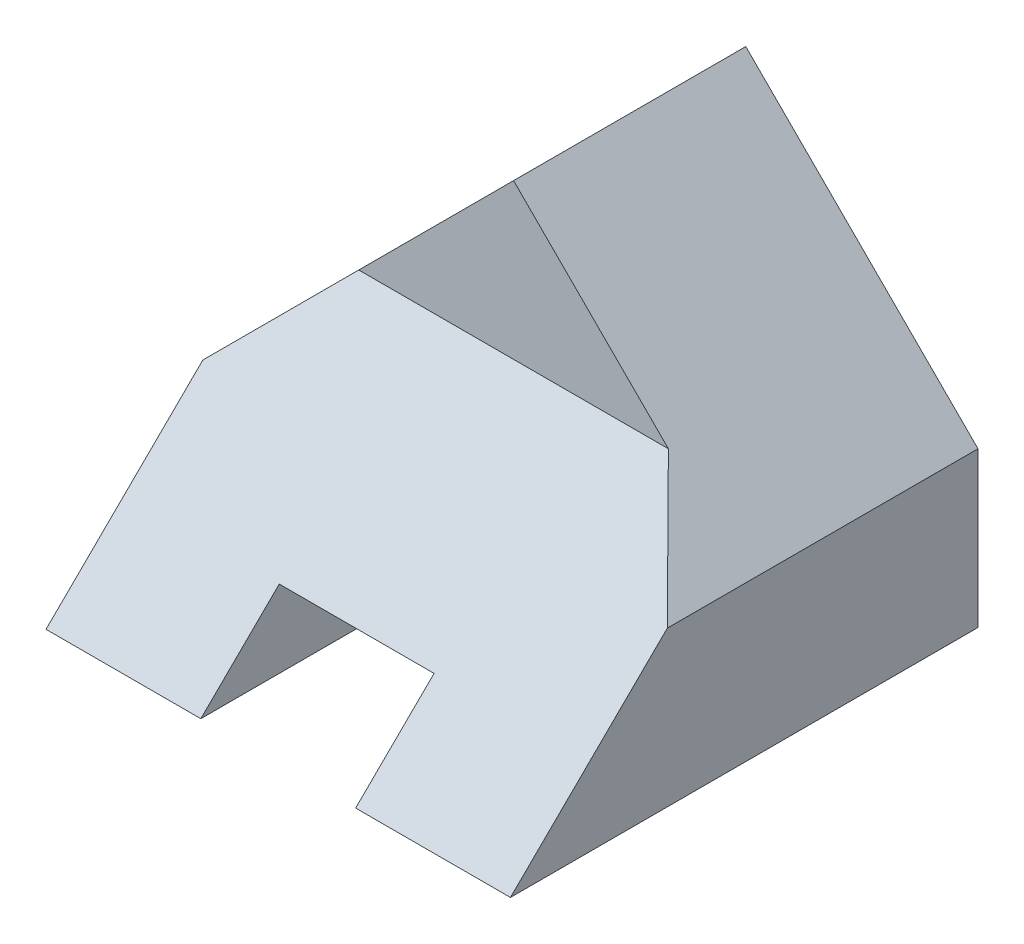
ISO-10303-21;
HEADER;
FILE_DESCRIPTION(('STEP AP214'),'2;1');
FILE_NAME('part.step','',(''),(''),'','','');
FILE_SCHEMA(('AUTOMOTIVE_DESIGN { 1 0 10303 214 1 1 1 1 }'));
ENDSEC;
DATA;
#1=APPLICATION_CONTEXT('core data for automotive mechanical design processes');
#2=APPLICATION_PROTOCOL_DEFINITION('international standard','automotive_design',2000,#1);
#3=PRODUCT_CONTEXT('',#1,'mechanical');
#4=PRODUCT('Part','Part','',(#3));
#5=PRODUCT_RELATED_PRODUCT_CATEGORY('part','',(#4));
#6=PRODUCT_DEFINITION_FORMATION('','',#4);
#7=PRODUCT_DEFINITION_CONTEXT('part definition',#1,'design');
#8=PRODUCT_DEFINITION('design','',#6,#7);
#9=PRODUCT_DEFINITION_SHAPE('','',#8);
#10=(LENGTH_UNIT() NAMED_UNIT(*) SI_UNIT(.MILLI.,.METRE.));
#11=(NAMED_UNIT(*) PLANE_ANGLE_UNIT() SI_UNIT($,.RADIAN.));
#12=(NAMED_UNIT(*) SI_UNIT($,.STERADIAN.) SOLID_ANGLE_UNIT());
#13=UNCERTAINTY_MEASURE_WITH_UNIT(LENGTH_MEASURE(1.E-05),#10,'distance_accuracy_value','');
#14=(GEOMETRIC_REPRESENTATION_CONTEXT(3) GLOBAL_UNCERTAINTY_ASSIGNED_CONTEXT((#13)) GLOBAL_UNIT_ASSIGNED_CONTEXT((#10,
#11,#12)) REPRESENTATION_CONTEXT('',''));
#15=CARTESIAN_POINT('',(0.,0.,0.));
#16=DIRECTION('',(0.,0.,1.));
#17=DIRECTION('',(1.,0.,0.));
#18=AXIS2_PLACEMENT_3D('',#15,#16,#17);
#19=CARTESIAN_POINT('',(-3.,3.,0.));
#20=DIRECTION('',(0.,0.711795278981086,0.702386987934884));
#21=DIRECTION('',(0.,-0.702386987934884,0.711795278981086));
#22=AXIS2_PLACEMENT_3D('',#19,#20,#21);
#23=PLANE('',#22);
#24=DIRECTION('',(1.,0.,0.));
#25=VECTOR('',#24,1.);
#26=CARTESIAN_POINT('',(-3.,1.,2.02678947989587));
#27=LINE('',#26,#25);
#28=CARTESIAN_POINT('',(-1.,0.999999999999999,2.02678947989588));
#29=VERTEX_POINT('',#28);
#30=CARTESIAN_POINT('',(1.,1.,2.02678947989587));
#31=VERTEX_POINT('',#30);
#32=EDGE_CURVE('E11',#29,#31,#27,.T.);
#33=ORIENTED_EDGE('',*,*,#32,.T.);
#34=DIRECTION('',(0.,-0.702386987934884,0.711795278981086));
#35=VECTOR('',#34,1.);
#36=CARTESIAN_POINT('',(1.,3.,0.));
#37=LINE('',#36,#35);
#38=CARTESIAN_POINT('',(1.,0.,3.04018421984381));
#39=VERTEX_POINT('',#38);
#40=EDGE_CURVE('E182',#31,#39,#37,.T.);
#41=ORIENTED_EDGE('',*,*,#40,.T.);
#42=DIRECTION('',(1.,0.,0.));
#43=VECTOR('',#42,1.);
#44=CARTESIAN_POINT('',(-3.,0.,3.04018421984381));
#45=LINE('',#44,#43);
#46=CARTESIAN_POINT('',(3.,0.,3.04018421984381));
#47=VERTEX_POINT('',#46);
#48=EDGE_CURVE('E129',#39,#47,#45,.T.);
#49=ORIENTED_EDGE('',*,*,#48,.T.);
#50=DIRECTION('',(0.,-0.702386987934884,0.711795278981086));
#51=VECTOR('',#50,1.);
#52=CARTESIAN_POINT('',(3.,3.,0.));
#53=LINE('',#52,#51);
#54=CARTESIAN_POINT('',(3.,2.,1.01339473994794));
#55=VERTEX_POINT('',#54);
#56=EDGE_CURVE('E175',#55,#47,#53,.T.);
#57=ORIENTED_EDGE('',*,*,#56,.F.);
#58=DIRECTION('',(-0.574772552263184,0.574772552263184,-0.582471481129961));
#59=VECTOR('',#58,1.);
#60=CARTESIAN_POINT('',(0.348182565824324,4.65181743417567,-1.67394309914792));
#61=LINE('',#60,#59);
#62=CARTESIAN_POINT('',(2.,3.,0.));
#63=VERTEX_POINT('',#62);
#64=EDGE_CURVE('E179',#55,#63,#61,.T.);
#65=ORIENTED_EDGE('',*,*,#64,.T.);
#66=DIRECTION('',(1.,0.,0.));
#67=VECTOR('',#66,1.);
#68=CARTESIAN_POINT('',(-3.,3.,0.));
#69=LINE('',#68,#67);
#70=CARTESIAN_POINT('',(-2.,3.,0.));
#71=VERTEX_POINT('',#70);
#72=EDGE_CURVE('E135',#71,#63,#69,.T.);
#73=ORIENTED_EDGE('',*,*,#72,.F.);
#74=DIRECTION('',(-0.574772552263184,-0.574772552263184,0.582471481129961));
#75=VECTOR('',#74,1.);
#76=CARTESIAN_POINT('',(-2.33036348683514,2.66963651316487,0.334788619829585));
#77=LINE('',#76,#75);
#78=CARTESIAN_POINT('',(-3.,2.,1.01339473994794));
#79=VERTEX_POINT('',#78);
#80=EDGE_CURVE('E131',#71,#79,#77,.T.);
#81=ORIENTED_EDGE('',*,*,#80,.T.);
#82=DIRECTION('',(0.,-0.702386987934884,0.711795278981086));
#83=VECTOR('',#82,1.);
#84=CARTESIAN_POINT('',(-3.,3.,0.));
#85=LINE('',#84,#83);
#86=CARTESIAN_POINT('',(-3.,0.,3.04018421984381));
#87=VERTEX_POINT('',#86);
#88=EDGE_CURVE('E178',#79,#87,#85,.T.);
#89=ORIENTED_EDGE('',*,*,#88,.T.);
#90=CARTESIAN_POINT('',(-1.,0.,3.04018421984381));
#91=VERTEX_POINT('',#90);
#92=EDGE_CURVE('E158',#87,#91,#45,.T.);
#93=ORIENTED_EDGE('',*,*,#92,.T.);
#94=DIRECTION('',(0.,0.702386987934884,-0.711795278981086));
#95=VECTOR('',#94,1.);
#96=CARTESIAN_POINT('',(-1.,3.,0.));
#97=LINE('',#96,#95);
#98=EDGE_CURVE('E184',#91,#29,#97,.T.);
#99=ORIENTED_EDGE('',*,*,#98,.T.);
#100=EDGE_LOOP('',(#33,#41,#49,#57,#65,#73,#81,#89,#93,#99));
#101=FACE_BOUND('',#100,.T.);
#102=ADVANCED_FACE('F33',(#101),#23,.T.);
#103=CARTESIAN_POINT('',(3.,0.,-3.));
#104=DIRECTION('',(0.,-1.,0.));
#105=DIRECTION('',(1.,0.,0.));
#106=AXIS2_PLACEMENT_3D('',#103,#104,#105);
#107=PLANE('',#106);
#108=ORIENTED_EDGE('',*,*,#48,.F.);
#109=DIRECTION('',(0.,0.,-1.));
#110=VECTOR('',#109,1.);
#111=CARTESIAN_POINT('',(1.,0.,-3.));
#112=LINE('',#111,#110);
#113=CARTESIAN_POINT('',(1.,0.,0.));
#114=VERTEX_POINT('',#113);
#115=EDGE_CURVE('E41',#39,#114,#112,.T.);
#116=ORIENTED_EDGE('',*,*,#115,.T.);
#117=DIRECTION('',(1.,0.,0.));
#118=VECTOR('',#117,1.);
#119=CARTESIAN_POINT('',(1.,0.,0.));
#120=LINE('',#119,#118);
#121=CARTESIAN_POINT('',(-1.,0.,0.));
#122=VERTEX_POINT('',#121);
#123=EDGE_CURVE('E119',#122,#114,#120,.T.);
#124=ORIENTED_EDGE('',*,*,#123,.F.);
#125=DIRECTION('',(0.,0.,1.));
#126=VECTOR('',#125,1.);
#127=CARTESIAN_POINT('',(-1.,0.,-3.));
#128=LINE('',#127,#126);
#129=EDGE_CURVE('E130',#122,#91,#128,.T.);
#130=ORIENTED_EDGE('',*,*,#129,.T.);
#131=ORIENTED_EDGE('',*,*,#92,.F.);
#132=DIRECTION('',(0.,0.,1.));
#133=VECTOR('',#132,1.);
#134=CARTESIAN_POINT('',(-3.,0.,-3.));
#135=LINE('',#134,#133);
#136=CARTESIAN_POINT('',(-3.,0.,-3.));
#137=VERTEX_POINT('',#136);
#138=EDGE_CURVE('E145',#137,#87,#135,.T.);
#139=ORIENTED_EDGE('',*,*,#138,.F.);
#140=DIRECTION('',(1.,0.,0.));
#141=VECTOR('',#140,1.);
#142=CARTESIAN_POINT('',(3.,0.,-3.));
#143=LINE('',#142,#141);
#144=CARTESIAN_POINT('',(3.,0.,-3.));
#145=VERTEX_POINT('',#144);
#146=EDGE_CURVE('E166',#137,#145,#143,.T.);
#147=ORIENTED_EDGE('',*,*,#146,.T.);
#148=DIRECTION('',(0.,0.,1.));
#149=VECTOR('',#148,1.);
#150=CARTESIAN_POINT('',(3.,0.,-3.));
#151=LINE('',#150,#149);
#152=EDGE_CURVE('E141',#145,#47,#151,.T.);
#153=ORIENTED_EDGE('',*,*,#152,.T.);
#154=EDGE_LOOP('',(#108,#116,#124,#130,#131,#139,#147,#153));
#155=FACE_BOUND('',#154,.T.);
#156=ADVANCED_FACE('F127',(#155),#107,.T.);
#157=CARTESIAN_POINT('',(3.,0.,-3.));
#158=DIRECTION('',(1.,0.,0.));
#159=DIRECTION('',(0.,0.,-1.));
#160=AXIS2_PLACEMENT_3D('',#157,#158,#159);
#161=PLANE('',#160);
#162=DIRECTION('',(0.,0.,1.));
#163=VECTOR('',#162,1.);
#164=CARTESIAN_POINT('',(3.,2.,-3.));
#165=LINE('',#164,#163);
#166=CARTESIAN_POINT('',(3.,2.,-3.));
#167=VERTEX_POINT('',#166);
#168=EDGE_CURVE('E138',#167,#55,#165,.T.);
#169=ORIENTED_EDGE('',*,*,#168,.T.);
#170=ORIENTED_EDGE('',*,*,#56,.T.);
#171=ORIENTED_EDGE('',*,*,#152,.F.);
#172=DIRECTION('',(0.,1.,0.));
#173=VECTOR('',#172,1.);
#174=CARTESIAN_POINT('',(3.,0.,-3.));
#175=LINE('',#174,#173);
#176=EDGE_CURVE('E163',#145,#167,#175,.T.);
#177=ORIENTED_EDGE('',*,*,#176,.T.);
#178=EDGE_LOOP('',(#169,#170,#171,#177));
#179=FACE_BOUND('',#178,.T.);
#180=ADVANCED_FACE('F208',(#179),#161,.T.);
#181=CARTESIAN_POINT('',(-3.,2.,-3.));
#182=DIRECTION('',(-1.,0.,0.));
#183=DIRECTION('',(0.,-1.,0.));
#184=AXIS2_PLACEMENT_3D('',#181,#182,#183);
#185=PLANE('',#184);
#186=ORIENTED_EDGE('',*,*,#88,.F.);
#187=DIRECTION('',(0.,0.,1.));
#188=VECTOR('',#187,1.);
#189=CARTESIAN_POINT('',(-3.,2.,-3.));
#190=LINE('',#189,#188);
#191=CARTESIAN_POINT('',(-3.,2.,-3.));
#192=VERTEX_POINT('',#191);
#193=EDGE_CURVE('E56',#192,#79,#190,.T.);
#194=ORIENTED_EDGE('',*,*,#193,.F.);
#195=DIRECTION('',(0.,-1.,0.));
#196=VECTOR('',#195,1.);
#197=CARTESIAN_POINT('',(-3.,2.,-3.));
#198=LINE('',#197,#196);
#199=EDGE_CURVE('E155',#192,#137,#198,.T.);
#200=ORIENTED_EDGE('',*,*,#199,.T.);
#201=ORIENTED_EDGE('',*,*,#138,.T.);
#202=EDGE_LOOP('',(#186,#194,#200,#201));
#203=FACE_BOUND('',#202,.T.);
#204=ADVANCED_FACE('F35',(#203),#185,.T.);
#205=CARTESIAN_POINT('',(0.,5.,-3.));
#206=DIRECTION('',(-0.707106781186548,0.707106781186547,0.));
#207=DIRECTION('',(-0.707106781186547,-0.707106781186548,0.));
#208=AXIS2_PLACEMENT_3D('',#205,#206,#207);
#209=PLANE('',#208);
#210=DIRECTION('',(-0.707106781186547,-0.707106781186548,0.));
#211=VECTOR('',#210,1.);
#212=CARTESIAN_POINT('',(0.,5.,0.));
#213=LINE('',#212,#211);
#214=CARTESIAN_POINT('',(0.,5.,0.));
#215=VERTEX_POINT('',#214);
#216=EDGE_CURVE('E152',#215,#71,#213,.T.);
#217=ORIENTED_EDGE('',*,*,#216,.F.);
#218=DIRECTION('',(0.,0.,1.));
#219=VECTOR('',#218,1.);
#220=CARTESIAN_POINT('',(0.,5.,-3.));
#221=LINE('',#220,#219);
#222=CARTESIAN_POINT('',(0.,5.,-3.));
#223=VERTEX_POINT('',#222);
#224=EDGE_CURVE('E140',#223,#215,#221,.T.);
#225=ORIENTED_EDGE('',*,*,#224,.F.);
#226=DIRECTION('',(-0.707106781186547,-0.707106781186548,0.));
#227=VECTOR('',#226,1.);
#228=CARTESIAN_POINT('',(0.,5.,-3.));
#229=LINE('',#228,#227);
#230=EDGE_CURVE('E148',#223,#192,#229,.T.);
#231=ORIENTED_EDGE('',*,*,#230,.T.);
#232=ORIENTED_EDGE('',*,*,#193,.T.);
#233=ORIENTED_EDGE('',*,*,#80,.F.);
#234=EDGE_LOOP('',(#217,#225,#231,#232,#233));
#235=FACE_BOUND('',#234,.T.);
#236=ADVANCED_FACE('F233',(#235),#209,.T.);
#237=CARTESIAN_POINT('',(3.,2.,-3.));
#238=DIRECTION('',(0.707106781186547,0.707106781186548,0.));
#239=DIRECTION('',(-0.707106781186548,0.707106781186547,0.));
#240=AXIS2_PLACEMENT_3D('',#237,#238,#239);
#241=PLANE('',#240);
#242=DIRECTION('',(-0.707106781186548,0.707106781186547,0.));
#243=VECTOR('',#242,1.);
#244=CARTESIAN_POINT('',(3.,2.,0.));
#245=LINE('',#244,#243);
#246=EDGE_CURVE('E156',#63,#215,#245,.T.);
#247=ORIENTED_EDGE('',*,*,#246,.F.);
#248=ORIENTED_EDGE('',*,*,#64,.F.);
#249=ORIENTED_EDGE('',*,*,#168,.F.);
#250=DIRECTION('',(-0.707106781186548,0.707106781186547,0.));
#251=VECTOR('',#250,1.);
#252=CARTESIAN_POINT('',(3.,2.,-3.));
#253=LINE('',#252,#251);
#254=EDGE_CURVE('E160',#167,#223,#253,.T.);
#255=ORIENTED_EDGE('',*,*,#254,.T.);
#256=ORIENTED_EDGE('',*,*,#224,.T.);
#257=EDGE_LOOP('',(#247,#248,#249,#255,#256));
#258=FACE_BOUND('',#257,.T.);
#259=ADVANCED_FACE('F229',(#258),#241,.T.);
#260=CARTESIAN_POINT('',(0.,0.,-3.));
#261=DIRECTION('',(0.,0.,-1.));
#262=DIRECTION('',(-1.,0.,0.));
#263=AXIS2_PLACEMENT_3D('',#260,#261,#262);
#264=PLANE('',#263);
#265=ORIENTED_EDGE('',*,*,#199,.F.);
#266=ORIENTED_EDGE('',*,*,#230,.F.);
#267=ORIENTED_EDGE('',*,*,#254,.F.);
#268=ORIENTED_EDGE('',*,*,#176,.F.);
#269=ORIENTED_EDGE('',*,*,#146,.F.);
#270=EDGE_LOOP('',(#265,#266,#267,#268,#269));
#271=FACE_BOUND('',#270,.T.);
#272=ADVANCED_FACE('F204',(#271),#264,.T.);
#273=CARTESIAN_POINT('',(0.,0.,0.));
#274=DIRECTION('',(0.,0.,-1.));
#275=DIRECTION('',(-1.,0.,0.));
#276=AXIS2_PLACEMENT_3D('',#273,#274,#275);
#277=PLANE('',#276);
#278=ORIENTED_EDGE('',*,*,#216,.T.);
#279=ORIENTED_EDGE('',*,*,#72,.T.);
#280=ORIENTED_EDGE('',*,*,#246,.T.);
#281=EDGE_LOOP('',(#278,#279,#280));
#282=FACE_BOUND('',#281,.T.);
#283=ADVANCED_FACE('F219',(#282),#277,.F.);
#284=CARTESIAN_POINT('',(1.,1.,6.));
#285=DIRECTION('',(-1.,0.,0.));
#286=DIRECTION('',(0.,0.,1.));
#287=AXIS2_PLACEMENT_3D('',#284,#285,#286);
#288=PLANE('',#287);
#289=DIRECTION('',(0.,0.,-1.));
#290=VECTOR('',#289,1.);
#291=CARTESIAN_POINT('',(1.,1.,6.));
#292=LINE('',#291,#290);
#293=CARTESIAN_POINT('',(1.,1.,0.));
#294=VERTEX_POINT('',#293);
#295=EDGE_CURVE('E116',#31,#294,#292,.T.);
#296=ORIENTED_EDGE('',*,*,#295,.T.);
#297=DIRECTION('',(0.,1.,0.));
#298=VECTOR('',#297,1.);
#299=CARTESIAN_POINT('',(1.,1.,0.));
#300=LINE('',#299,#298);
#301=EDGE_CURVE('E111',#114,#294,#300,.T.);
#302=ORIENTED_EDGE('',*,*,#301,.F.);
#303=ORIENTED_EDGE('',*,*,#115,.F.);
#304=ORIENTED_EDGE('',*,*,#40,.F.);
#305=EDGE_LOOP('',(#296,#302,#303,#304));
#306=FACE_BOUND('',#305,.T.);
#307=ADVANCED_FACE('F112',(#306),#288,.T.);
#308=CARTESIAN_POINT('',(-1.,1.,6.));
#309=DIRECTION('',(0.,-1.,0.));
#310=DIRECTION('',(0.,0.,-1.));
#311=AXIS2_PLACEMENT_3D('',#308,#309,#310);
#312=PLANE('',#311);
#313=DIRECTION('',(0.,0.,-1.));
#314=VECTOR('',#313,1.);
#315=CARTESIAN_POINT('',(-1.,1.,6.));
#316=LINE('',#315,#314);
#317=CARTESIAN_POINT('',(-1.,1.,0.));
#318=VERTEX_POINT('',#317);
#319=EDGE_CURVE('E188',#29,#318,#316,.T.);
#320=ORIENTED_EDGE('',*,*,#319,.T.);
#321=DIRECTION('',(-1.,0.,0.));
#322=VECTOR('',#321,1.);
#323=CARTESIAN_POINT('',(-1.,1.,0.));
#324=LINE('',#323,#322);
#325=EDGE_CURVE('E118',#294,#318,#324,.T.);
#326=ORIENTED_EDGE('',*,*,#325,.F.);
#327=ORIENTED_EDGE('',*,*,#295,.F.);
#328=ORIENTED_EDGE('',*,*,#32,.F.);
#329=EDGE_LOOP('',(#320,#326,#327,#328));
#330=FACE_BOUND('',#329,.T.);
#331=ADVANCED_FACE('F211',(#330),#312,.T.);
#332=CARTESIAN_POINT('',(-1.,0.,6.));
#333=DIRECTION('',(1.,0.,0.));
#334=DIRECTION('',(0.,0.,-1.));
#335=AXIS2_PLACEMENT_3D('',#332,#333,#334);
#336=PLANE('',#335);
#337=ORIENTED_EDGE('',*,*,#129,.F.);
#338=DIRECTION('',(0.,-1.,0.));
#339=VECTOR('',#338,1.);
#340=CARTESIAN_POINT('',(-1.,0.,0.));
#341=LINE('',#340,#339);
#342=EDGE_CURVE('E48',#318,#122,#341,.T.);
#343=ORIENTED_EDGE('',*,*,#342,.F.);
#344=ORIENTED_EDGE('',*,*,#319,.F.);
#345=ORIENTED_EDGE('',*,*,#98,.F.);
#346=EDGE_LOOP('',(#337,#343,#344,#345));
#347=FACE_BOUND('',#346,.T.);
#348=ADVANCED_FACE('F194',(#347),#336,.T.);
#349=CARTESIAN_POINT('',(0.,0.,0.));
#350=DIRECTION('',(0.,0.,-1.));
#351=DIRECTION('',(-1.,0.,0.));
#352=AXIS2_PLACEMENT_3D('',#349,#350,#351);
#353=PLANE('',#352);
#354=ORIENTED_EDGE('',*,*,#123,.T.);
#355=ORIENTED_EDGE('',*,*,#301,.T.);
#356=ORIENTED_EDGE('',*,*,#325,.T.);
#357=ORIENTED_EDGE('',*,*,#342,.T.);
#358=EDGE_LOOP('',(#354,#355,#356,#357));
#359=FACE_BOUND('',#358,.T.);
#360=ADVANCED_FACE('F122',(#359),#353,.F.);
#361=CLOSED_SHELL('',(#102,#156,#180,#204,#236,#259,#272,#283,#307,#331,#348,#360));
#362=MANIFOLD_SOLID_BREP('B2',#361);
#363=ADVANCED_BREP_SHAPE_REPRESENTATION('',(#18,#362),#14);
#364=SHAPE_DEFINITION_REPRESENTATION(#9,#363);
ENDSEC;
END-ISO-10303-21;
